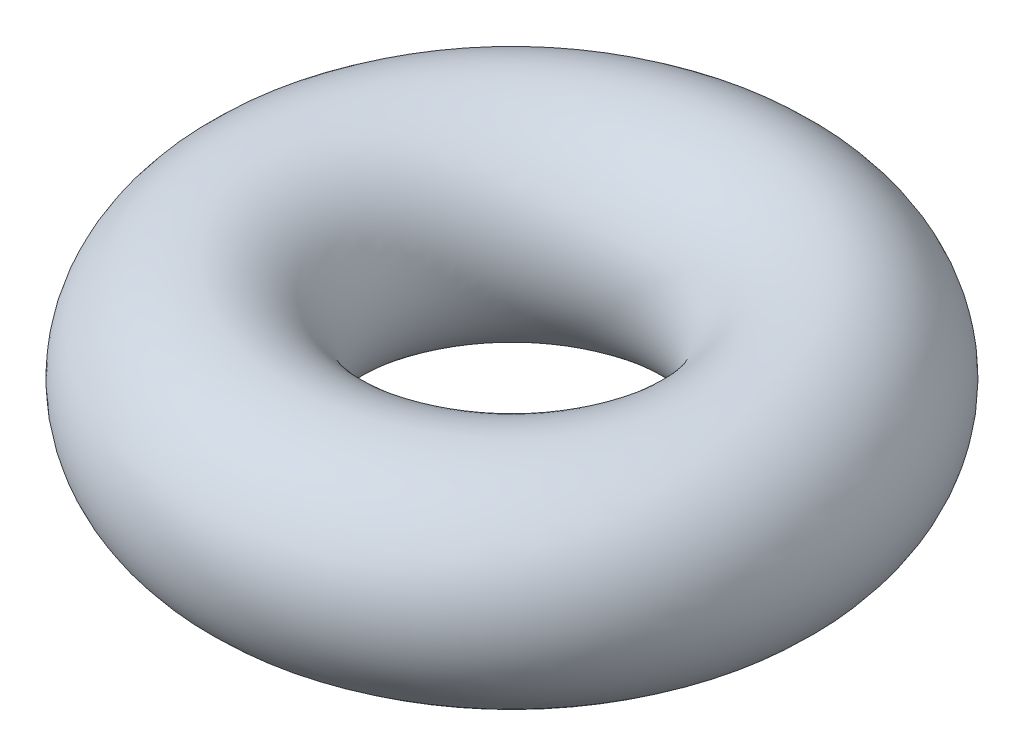
ISO-10303-21;
HEADER;
FILE_DESCRIPTION(('STEP AP214'),'2;1');
FILE_NAME('part.step','',(''),(''),'','','');
FILE_SCHEMA(('AUTOMOTIVE_DESIGN { 1 0 10303 214 1 1 1 1 }'));
ENDSEC;
DATA;
#1=APPLICATION_CONTEXT('core data for automotive mechanical design processes');
#2=APPLICATION_PROTOCOL_DEFINITION('international standard','automotive_design',2000,#1);
#3=PRODUCT_CONTEXT('',#1,'mechanical');
#4=PRODUCT('Part','Part','',(#3));
#5=PRODUCT_RELATED_PRODUCT_CATEGORY('part','',(#4));
#6=PRODUCT_DEFINITION_FORMATION('','',#4);
#7=PRODUCT_DEFINITION_CONTEXT('part definition',#1,'design');
#8=PRODUCT_DEFINITION('design','',#6,#7);
#9=PRODUCT_DEFINITION_SHAPE('','',#8);
#10=(LENGTH_UNIT() NAMED_UNIT(*) SI_UNIT(.MILLI.,.METRE.));
#11=(NAMED_UNIT(*) PLANE_ANGLE_UNIT() SI_UNIT($,.RADIAN.));
#12=(NAMED_UNIT(*) SI_UNIT($,.STERADIAN.) SOLID_ANGLE_UNIT());
#13=UNCERTAINTY_MEASURE_WITH_UNIT(LENGTH_MEASURE(1.E-05),#10,'distance_accuracy_value','');
#14=(GEOMETRIC_REPRESENTATION_CONTEXT(3) GLOBAL_UNCERTAINTY_ASSIGNED_CONTEXT((#13)) GLOBAL_UNIT_ASSIGNED_CONTEXT((#10,
#11,#12)) REPRESENTATION_CONTEXT('',''));
#15=CARTESIAN_POINT('',(0.,0.,0.));
#16=DIRECTION('',(0.,0.,1.));
#17=DIRECTION('',(1.,0.,0.));
#18=AXIS2_PLACEMENT_3D('',#15,#16,#17);
#19=CARTESIAN_POINT('',(0.,0.,0.));
#20=DIRECTION('',(0.,-1.,0.));
#21=DIRECTION('',(1.,0.,0.));
#22=AXIS2_PLACEMENT_3D('',#19,#20,#21);
#23=TOROIDAL_SURFACE('',#22,2.0475,0.952500000000001);
#24=CARTESIAN_POINT('',(3.,0.,0.));
#25=VERTEX_POINT('',#24);
#26=VERTEX_LOOP('',#25);
#27=FACE_BOUND('',#26,.T.);
#28=ADVANCED_FACE('F37',(#27),#23,.T.);
#29=CLOSED_SHELL('',(#28));
#30=MANIFOLD_SOLID_BREP('B2',#29);
#31=ADVANCED_BREP_SHAPE_REPRESENTATION('',(#18,#30),#14);
#32=SHAPE_DEFINITION_REPRESENTATION(#9,#31);
ENDSEC;
END-ISO-10303-21;
